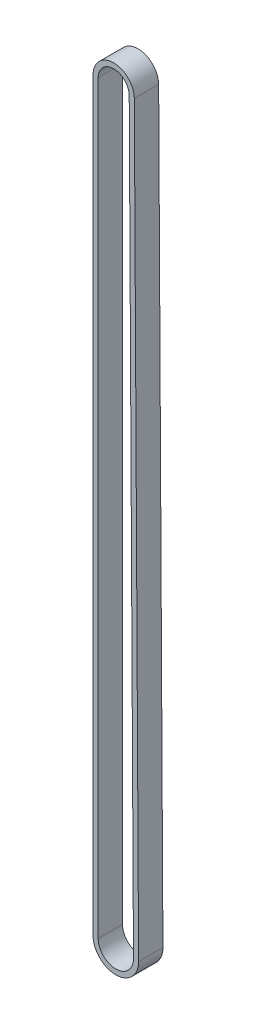
ISO-10303-21;
HEADER;
FILE_DESCRIPTION(('STEP AP214'),'2;1');
FILE_NAME('part.step','',(''),(''),'','','');
FILE_SCHEMA(('AUTOMOTIVE_DESIGN { 1 0 10303 214 1 1 1 1 }'));
ENDSEC;
DATA;
#1=APPLICATION_CONTEXT('core data for automotive mechanical design processes');
#2=APPLICATION_PROTOCOL_DEFINITION('international standard','automotive_design',2000,#1);
#3=PRODUCT_CONTEXT('',#1,'mechanical');
#4=PRODUCT('Part','Part','',(#3));
#5=PRODUCT_RELATED_PRODUCT_CATEGORY('part','',(#4));
#6=PRODUCT_DEFINITION_FORMATION('','',#4);
#7=PRODUCT_DEFINITION_CONTEXT('part definition',#1,'design');
#8=PRODUCT_DEFINITION('design','',#6,#7);
#9=PRODUCT_DEFINITION_SHAPE('','',#8);
#10=(LENGTH_UNIT() NAMED_UNIT(*) SI_UNIT(.MILLI.,.METRE.));
#11=(NAMED_UNIT(*) PLANE_ANGLE_UNIT() SI_UNIT($,.RADIAN.));
#12=(NAMED_UNIT(*) SI_UNIT($,.STERADIAN.) SOLID_ANGLE_UNIT());
#13=UNCERTAINTY_MEASURE_WITH_UNIT(LENGTH_MEASURE(1.E-05),#10,'distance_accuracy_value','');
#14=(GEOMETRIC_REPRESENTATION_CONTEXT(3) GLOBAL_UNCERTAINTY_ASSIGNED_CONTEXT((#13)) GLOBAL_UNIT_ASSIGNED_CONTEXT((#10,
#11,#12)) REPRESENTATION_CONTEXT('',''));
#15=CARTESIAN_POINT('',(0.,0.,0.));
#16=DIRECTION('',(0.,0.,1.));
#17=DIRECTION('',(1.,0.,0.));
#18=AXIS2_PLACEMENT_3D('',#15,#16,#17);
#19=CARTESIAN_POINT('',(330.556453180625,-302.445914231936,-6.2));
#20=DIRECTION('',(0.,0.,1.));
#21=DIRECTION('',(1.,0.,0.));
#22=AXIS2_PLACEMENT_3D('',#19,#20,#21);
#23=CYLINDRICAL_SURFACE('',#22,5.80000000000013);
#24=CARTESIAN_POINT('',(330.556453180625,-302.445914231936,0.));
#25=DIRECTION('',(0.,0.,1.));
#26=DIRECTION('',(-1.,0.,0.));
#27=AXIS2_PLACEMENT_3D('',#24,#25,#26);
#28=CIRCLE('',#27,5.80000000000013);
#29=CARTESIAN_POINT('',(324.756453180624,-302.445914231936,0.));
#30=VERTEX_POINT('',#29);
#31=CARTESIAN_POINT('',(336.35635749088,-302.412597691275,0.));
#32=VERTEX_POINT('',#31);
#33=EDGE_CURVE('E131',#30,#32,#28,.T.);
#34=ORIENTED_EDGE('',*,*,#33,.F.);
#35=DIRECTION('',(0.,0.,1.));
#36=VECTOR('',#35,1.);
#37=CARTESIAN_POINT('',(324.756453180624,-302.445914231936,-6.2));
#38=LINE('',#37,#36);
#39=CARTESIAN_POINT('',(324.756453180624,-302.445914231936,-6.2));
#40=VERTEX_POINT('',#39);
#41=EDGE_CURVE('E11',#40,#30,#38,.T.);
#42=ORIENTED_EDGE('',*,*,#41,.F.);
#43=CARTESIAN_POINT('',(330.556453180625,-302.445914231936,-6.2));
#44=DIRECTION('',(0.,0.,1.));
#45=DIRECTION('',(-1.,0.,0.));
#46=AXIS2_PLACEMENT_3D('',#43,#44,#45);
#47=CIRCLE('',#46,5.80000000000013);
#48=CARTESIAN_POINT('',(336.35635749088,-302.412597691275,-6.2));
#49=VERTEX_POINT('',#48);
#50=EDGE_CURVE('E135',#40,#49,#47,.T.);
#51=ORIENTED_EDGE('',*,*,#50,.T.);
#52=DIRECTION('',(0.,0.,1.));
#53=VECTOR('',#52,1.);
#54=CARTESIAN_POINT('',(336.35635749088,-302.412597691275,-6.2));
#55=LINE('',#54,#53);
#56=EDGE_CURVE('E36',#49,#32,#55,.T.);
#57=ORIENTED_EDGE('',*,*,#56,.T.);
#58=EDGE_LOOP('',(#34,#42,#51,#57));
#59=FACE_BOUND('',#58,.T.);
#60=ADVANCED_FACE('F33',(#59),#23,.T.);
#61=CARTESIAN_POINT('',(324.756453180624,-302.445914231936,-6.2));
#62=DIRECTION('',(-1.,0.,0.));
#63=DIRECTION('',(0.,-1.,0.));
#64=AXIS2_PLACEMENT_3D('',#61,#62,#63);
#65=PLANE('',#64);
#66=DIRECTION('',(0.,-1.,0.));
#67=VECTOR('',#66,1.);
#68=CARTESIAN_POINT('',(324.756453180624,-302.445914231936,0.));
#69=LINE('',#68,#67);
#70=CARTESIAN_POINT('',(324.756453180625,-112.552615582547,0.));
#71=VERTEX_POINT('',#70);
#72=EDGE_CURVE('E139',#71,#30,#69,.T.);
#73=ORIENTED_EDGE('',*,*,#72,.F.);
#74=DIRECTION('',(0.,0.,1.));
#75=VECTOR('',#74,1.);
#76=CARTESIAN_POINT('',(324.756453180625,-112.552615582547,-6.2));
#77=LINE('',#76,#75);
#78=CARTESIAN_POINT('',(324.756453180625,-112.552615582547,-6.2));
#79=VERTEX_POINT('',#78);
#80=EDGE_CURVE('E41',#79,#71,#77,.T.);
#81=ORIENTED_EDGE('',*,*,#80,.F.);
#82=DIRECTION('',(0.,-1.,0.));
#83=VECTOR('',#82,1.);
#84=CARTESIAN_POINT('',(324.756453180624,-302.445914231936,-6.2));
#85=LINE('',#84,#83);
#86=EDGE_CURVE('E145',#79,#40,#85,.T.);
#87=ORIENTED_EDGE('',*,*,#86,.T.);
#88=ORIENTED_EDGE('',*,*,#41,.T.);
#89=EDGE_LOOP('',(#73,#81,#87,#88));
#90=FACE_BOUND('',#89,.T.);
#91=ADVANCED_FACE('F171',(#90),#65,.T.);
#92=CARTESIAN_POINT('',(330.011053181054,-112.552615582547,-6.2));
#93=DIRECTION('',(0.,0.,1.));
#94=DIRECTION('',(1.,0.,0.));
#95=AXIS2_PLACEMENT_3D('',#92,#93,#94);
#96=CYLINDRICAL_SURFACE('',#95,5.25460000042948);
#97=CARTESIAN_POINT('',(330.011053181054,-112.552615582547,0.));
#98=DIRECTION('',(0.,0.,1.));
#99=DIRECTION('',(1.,0.,0.));
#100=AXIS2_PLACEMENT_3D('',#97,#98,#99);
#101=CIRCLE('',#100,5.25460000042948);
#102=CARTESIAN_POINT('',(335.265566489875,-112.522431945551,0.));
#103=VERTEX_POINT('',#102);
#104=EDGE_CURVE('E153',#103,#71,#101,.T.);
#105=ORIENTED_EDGE('',*,*,#104,.F.);
#106=DIRECTION('',(0.,0.,1.));
#107=VECTOR('',#106,1.);
#108=CARTESIAN_POINT('',(335.265566489875,-112.522431945551,-6.2));
#109=LINE('',#108,#107);
#110=CARTESIAN_POINT('',(335.265566489875,-112.522431945551,-6.2));
#111=VERTEX_POINT('',#110);
#112=EDGE_CURVE('E158',#111,#103,#109,.T.);
#113=ORIENTED_EDGE('',*,*,#112,.F.);
#114=CARTESIAN_POINT('',(330.011053181054,-112.552615582547,-6.2));
#115=DIRECTION('',(0.,0.,1.));
#116=DIRECTION('',(1.,0.,0.));
#117=AXIS2_PLACEMENT_3D('',#114,#115,#116);
#118=CIRCLE('',#117,5.25460000042948);
#119=EDGE_CURVE('E142',#111,#79,#118,.T.);
#120=ORIENTED_EDGE('',*,*,#119,.T.);
#121=ORIENTED_EDGE('',*,*,#80,.T.);
#122=EDGE_LOOP('',(#105,#113,#120,#121));
#123=FACE_BOUND('',#122,.T.);
#124=ADVANCED_FACE('F175',(#123),#96,.T.);
#125=CARTESIAN_POINT('',(336.35635749088,-302.412597691275,-6.2));
#126=DIRECTION('',(0.99998350176816,0.00574423114856493,0.));
#127=DIRECTION('',(-0.00574423114856493,0.99998350176816,0.));
#128=AXIS2_PLACEMENT_3D('',#125,#126,#127);
#129=PLANE('',#128);
#130=DIRECTION('',(-0.00574423114856493,0.99998350176816,0.));
#131=VECTOR('',#130,1.);
#132=CARTESIAN_POINT('',(336.35635749088,-302.412597691275,0.));
#133=LINE('',#132,#131);
#134=EDGE_CURVE('E150',#32,#103,#133,.T.);
#135=ORIENTED_EDGE('',*,*,#134,.F.);
#136=ORIENTED_EDGE('',*,*,#56,.F.);
#137=DIRECTION('',(-0.00574423114856493,0.99998350176816,0.));
#138=VECTOR('',#137,1.);
#139=CARTESIAN_POINT('',(336.35635749088,-302.412597691275,-6.2));
#140=LINE('',#139,#138);
#141=EDGE_CURVE('E138',#49,#111,#140,.T.);
#142=ORIENTED_EDGE('',*,*,#141,.T.);
#143=ORIENTED_EDGE('',*,*,#112,.T.);
#144=EDGE_LOOP('',(#135,#136,#142,#143));
#145=FACE_BOUND('',#144,.T.);
#146=ADVANCED_FACE('F166',(#145),#129,.T.);
#147=CARTESIAN_POINT('',(330.556453180625,-302.445914231936,-6.2));
#148=DIRECTION('',(0.,0.,-1.));
#149=DIRECTION('',(-1.,0.,0.));
#150=AXIS2_PLACEMENT_3D('',#147,#148,#149);
#151=PLANE('',#150);
#152=CARTESIAN_POINT('',(330.556453180625,-302.445914231936,-6.2));
#153=DIRECTION('',(0.,0.,1.));
#154=DIRECTION('',(-1.,0.,0.));
#155=AXIS2_PLACEMENT_3D('',#152,#153,#154);
#156=CIRCLE('',#155,4.5);
#157=CARTESIAN_POINT('',(326.056453180625,-302.445914231936,-6.2));
#158=VERTEX_POINT('',#157);
#159=CARTESIAN_POINT('',(335.056378938581,-302.420065191768,-6.2));
#160=VERTEX_POINT('',#159);
#161=EDGE_CURVE('E100',#158,#160,#156,.T.);
#162=ORIENTED_EDGE('',*,*,#161,.T.);
#163=DIRECTION('',(-0.00574423114856405,0.99998350176816,0.));
#164=VECTOR('',#163,1.);
#165=CARTESIAN_POINT('',(335.056378938581,-302.420065191768,-6.2));
#166=LINE('',#165,#164);
#167=CARTESIAN_POINT('',(333.965587937576,-112.529899446045,-6.2));
#168=VERTEX_POINT('',#167);
#169=EDGE_CURVE('E109',#160,#168,#166,.T.);
#170=ORIENTED_EDGE('',*,*,#169,.T.);
#171=CARTESIAN_POINT('',(330.011053181054,-112.552615582547,-6.2));
#172=DIRECTION('',(0.,0.,1.));
#173=DIRECTION('',(1.,0.,0.));
#174=AXIS2_PLACEMENT_3D('',#171,#172,#173);
#175=CIRCLE('',#174,3.95460000042948);
#176=CARTESIAN_POINT('',(326.056453180625,-112.552615582547,-6.2));
#177=VERTEX_POINT('',#176);
#178=EDGE_CURVE('E49',#168,#177,#175,.T.);
#179=ORIENTED_EDGE('',*,*,#178,.T.);
#180=DIRECTION('',(0.,-1.,0.));
#181=VECTOR('',#180,1.);
#182=CARTESIAN_POINT('',(326.056453180625,-302.445914231936,-6.2));
#183=LINE('',#182,#181);
#184=EDGE_CURVE('E106',#177,#158,#183,.T.);
#185=ORIENTED_EDGE('',*,*,#184,.T.);
#186=EDGE_LOOP('',(#162,#170,#179,#185));
#187=FACE_BOUND('',#186,.T.);
#188=ORIENTED_EDGE('',*,*,#50,.F.);
#189=ORIENTED_EDGE('',*,*,#86,.F.);
#190=ORIENTED_EDGE('',*,*,#119,.F.);
#191=ORIENTED_EDGE('',*,*,#141,.F.);
#192=EDGE_LOOP('',(#188,#189,#190,#191));
#193=FACE_BOUND('',#192,.T.);
#194=ADVANCED_FACE('F113',(#187,#193),#151,.T.);
#195=CARTESIAN_POINT('',(330.556453180625,-302.445914231936,0.));
#196=DIRECTION('',(0.,0.,-1.));
#197=DIRECTION('',(-1.,0.,0.));
#198=AXIS2_PLACEMENT_3D('',#195,#196,#197);
#199=PLANE('',#198);
#200=DIRECTION('',(-0.00574423114856405,0.99998350176816,0.));
#201=VECTOR('',#200,1.);
#202=CARTESIAN_POINT('',(335.056378938581,-302.420065191768,0.));
#203=LINE('',#202,#201);
#204=CARTESIAN_POINT('',(335.056378938581,-302.420065191768,0.));
#205=VERTEX_POINT('',#204);
#206=CARTESIAN_POINT('',(333.965587937576,-112.529899446045,0.));
#207=VERTEX_POINT('',#206);
#208=EDGE_CURVE('E125',#205,#207,#203,.T.);
#209=ORIENTED_EDGE('',*,*,#208,.F.);
#210=CARTESIAN_POINT('',(330.556453180625,-302.445914231936,0.));
#211=DIRECTION('',(0.,0.,1.));
#212=DIRECTION('',(-1.,0.,0.));
#213=AXIS2_PLACEMENT_3D('',#210,#211,#212);
#214=CIRCLE('',#213,4.5);
#215=CARTESIAN_POINT('',(326.056453180625,-302.445914231936,0.));
#216=VERTEX_POINT('',#215);
#217=EDGE_CURVE('E57',#216,#205,#214,.T.);
#218=ORIENTED_EDGE('',*,*,#217,.F.);
#219=DIRECTION('',(0.,-1.,0.));
#220=VECTOR('',#219,1.);
#221=CARTESIAN_POINT('',(326.056453180625,-302.445914231936,0.));
#222=LINE('',#221,#220);
#223=CARTESIAN_POINT('',(326.056453180625,-112.552615582547,0.));
#224=VERTEX_POINT('',#223);
#225=EDGE_CURVE('E116',#224,#216,#222,.T.);
#226=ORIENTED_EDGE('',*,*,#225,.F.);
#227=CARTESIAN_POINT('',(330.011053181054,-112.552615582547,0.));
#228=DIRECTION('',(0.,0.,1.));
#229=DIRECTION('',(1.,0.,0.));
#230=AXIS2_PLACEMENT_3D('',#227,#228,#229);
#231=CIRCLE('',#230,3.95460000042948);
#232=EDGE_CURVE('E119',#207,#224,#231,.T.);
#233=ORIENTED_EDGE('',*,*,#232,.F.);
#234=EDGE_LOOP('',(#209,#218,#226,#233));
#235=FACE_BOUND('',#234,.T.);
#236=ORIENTED_EDGE('',*,*,#33,.T.);
#237=ORIENTED_EDGE('',*,*,#134,.T.);
#238=ORIENTED_EDGE('',*,*,#104,.T.);
#239=ORIENTED_EDGE('',*,*,#72,.T.);
#240=EDGE_LOOP('',(#236,#237,#238,#239));
#241=FACE_BOUND('',#240,.T.);
#242=ADVANCED_FACE('F168',(#235,#241),#199,.F.);
#243=CARTESIAN_POINT('',(330.556453180625,-302.445914231936,-6.2));
#244=DIRECTION('',(0.,0.,1.));
#245=DIRECTION('',(1.,0.,0.));
#246=AXIS2_PLACEMENT_3D('',#243,#244,#245);
#247=CYLINDRICAL_SURFACE('',#246,4.5);
#248=ORIENTED_EDGE('',*,*,#217,.T.);
#249=DIRECTION('',(0.,0.,1.));
#250=VECTOR('',#249,1.);
#251=CARTESIAN_POINT('',(335.056378938581,-302.420065191768,-6.2));
#252=LINE('',#251,#250);
#253=EDGE_CURVE('E96',#160,#205,#252,.T.);
#254=ORIENTED_EDGE('',*,*,#253,.F.);
#255=ORIENTED_EDGE('',*,*,#161,.F.);
#256=DIRECTION('',(0.,0.,1.));
#257=VECTOR('',#256,1.);
#258=CARTESIAN_POINT('',(326.056453180625,-302.445914231936,-6.2));
#259=LINE('',#258,#257);
#260=EDGE_CURVE('E129',#158,#216,#259,.T.);
#261=ORIENTED_EDGE('',*,*,#260,.T.);
#262=EDGE_LOOP('',(#248,#254,#255,#261));
#263=FACE_BOUND('',#262,.T.);
#264=ADVANCED_FACE('F98',(#263),#247,.F.);
#265=CARTESIAN_POINT('',(326.056453180625,-302.445914231936,-6.2));
#266=DIRECTION('',(-1.,0.,0.));
#267=DIRECTION('',(0.,0.,1.));
#268=AXIS2_PLACEMENT_3D('',#265,#266,#267);
#269=PLANE('',#268);
#270=ORIENTED_EDGE('',*,*,#225,.T.);
#271=ORIENTED_EDGE('',*,*,#260,.F.);
#272=ORIENTED_EDGE('',*,*,#184,.F.);
#273=DIRECTION('',(0.,0.,1.));
#274=VECTOR('',#273,1.);
#275=CARTESIAN_POINT('',(326.056453180625,-112.552615582547,-6.2));
#276=LINE('',#275,#274);
#277=EDGE_CURVE('E132',#177,#224,#276,.T.);
#278=ORIENTED_EDGE('',*,*,#277,.T.);
#279=EDGE_LOOP('',(#270,#271,#272,#278));
#280=FACE_BOUND('',#279,.T.);
#281=ADVANCED_FACE('F226',(#280),#269,.F.);
#282=CARTESIAN_POINT('',(330.011053181054,-112.552615582547,-6.2));
#283=DIRECTION('',(0.,0.,1.));
#284=DIRECTION('',(1.,0.,0.));
#285=AXIS2_PLACEMENT_3D('',#282,#283,#284);
#286=CYLINDRICAL_SURFACE('',#285,3.95460000042948);
#287=ORIENTED_EDGE('',*,*,#232,.T.);
#288=ORIENTED_EDGE('',*,*,#277,.F.);
#289=ORIENTED_EDGE('',*,*,#178,.F.);
#290=DIRECTION('',(0.,0.,1.));
#291=VECTOR('',#290,1.);
#292=CARTESIAN_POINT('',(333.965587937576,-112.529899446045,-6.2));
#293=LINE('',#292,#291);
#294=EDGE_CURVE('E105',#168,#207,#293,.T.);
#295=ORIENTED_EDGE('',*,*,#294,.T.);
#296=EDGE_LOOP('',(#287,#288,#289,#295));
#297=FACE_BOUND('',#296,.T.);
#298=ADVANCED_FACE('F235',(#297),#286,.F.);
#299=CARTESIAN_POINT('',(335.056378938581,-302.420065191768,-6.2));
#300=DIRECTION('',(0.99998350176816,0.00574423114856405,0.));
#301=DIRECTION('',(-0.00574423114856405,0.99998350176816,0.));
#302=AXIS2_PLACEMENT_3D('',#299,#300,#301);
#303=PLANE('',#302);
#304=ORIENTED_EDGE('',*,*,#208,.T.);
#305=ORIENTED_EDGE('',*,*,#294,.F.);
#306=ORIENTED_EDGE('',*,*,#169,.F.);
#307=ORIENTED_EDGE('',*,*,#253,.T.);
#308=EDGE_LOOP('',(#304,#305,#306,#307));
#309=FACE_BOUND('',#308,.T.);
#310=ADVANCED_FACE('F110',(#309),#303,.F.);
#311=CLOSED_SHELL('',(#60,#91,#124,#146,#194,#242,#264,#281,#298,#310));
#312=MANIFOLD_SOLID_BREP('B2',#311);
#313=ADVANCED_BREP_SHAPE_REPRESENTATION('',(#18,#312),#14);
#314=SHAPE_DEFINITION_REPRESENTATION(#9,#313);
ENDSEC;
END-ISO-10303-21;
